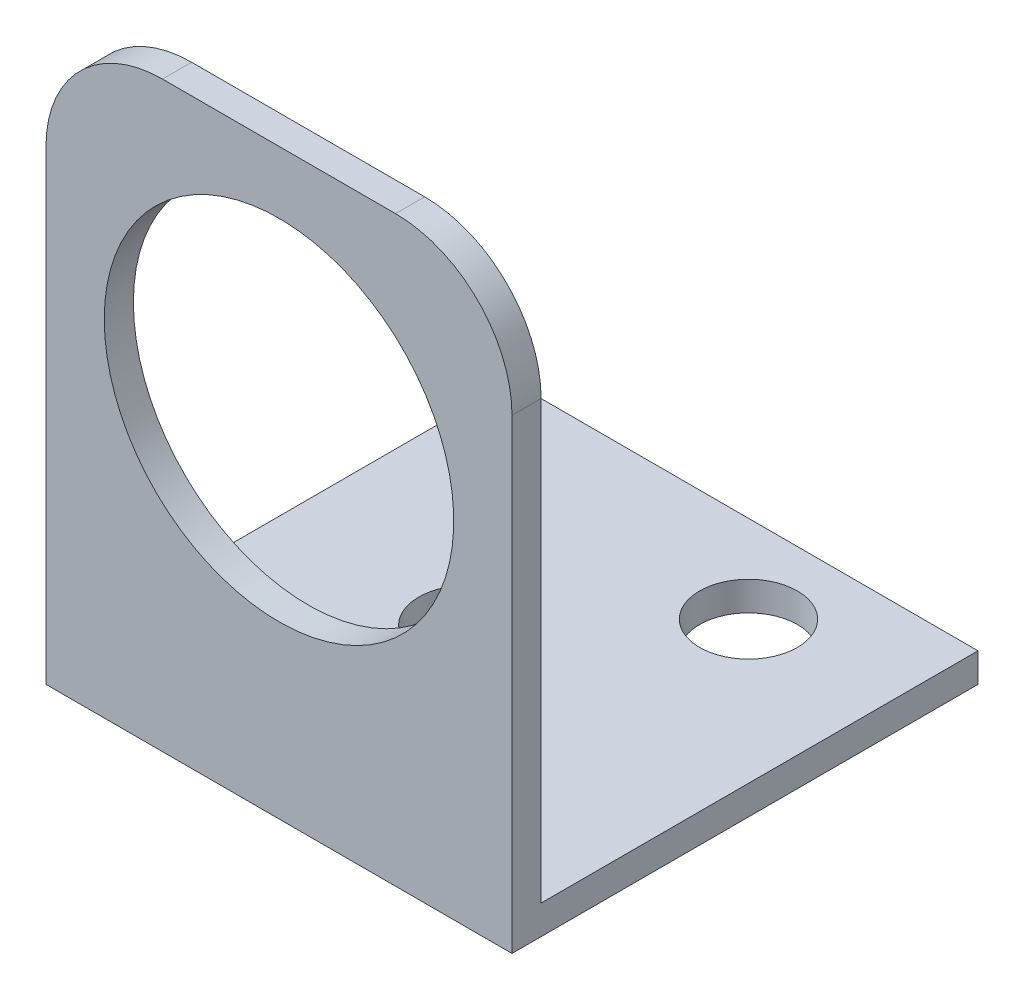
ISO-10303-21;
HEADER;
FILE_DESCRIPTION(('STEP AP214'),'2;1');
FILE_NAME('part.step','',(''),(''),'','','');
FILE_SCHEMA(('AUTOMOTIVE_DESIGN { 1 0 10303 214 1 1 1 1 }'));
ENDSEC;
DATA;
#1=APPLICATION_CONTEXT('core data for automotive mechanical design processes');
#2=APPLICATION_PROTOCOL_DEFINITION('international standard','automotive_design',2000,#1);
#3=PRODUCT_CONTEXT('',#1,'mechanical');
#4=PRODUCT('Part','Part','',(#3));
#5=PRODUCT_RELATED_PRODUCT_CATEGORY('part','',(#4));
#6=PRODUCT_DEFINITION_FORMATION('','',#4);
#7=PRODUCT_DEFINITION_CONTEXT('part definition',#1,'design');
#8=PRODUCT_DEFINITION('design','',#6,#7);
#9=PRODUCT_DEFINITION_SHAPE('','',#8);
#10=(LENGTH_UNIT() NAMED_UNIT(*) SI_UNIT(.MILLI.,.METRE.));
#11=(NAMED_UNIT(*) PLANE_ANGLE_UNIT() SI_UNIT($,.RADIAN.));
#12=(NAMED_UNIT(*) SI_UNIT($,.STERADIAN.) SOLID_ANGLE_UNIT());
#13=UNCERTAINTY_MEASURE_WITH_UNIT(LENGTH_MEASURE(1.E-05),#10,'distance_accuracy_value','');
#14=(GEOMETRIC_REPRESENTATION_CONTEXT(3) GLOBAL_UNCERTAINTY_ASSIGNED_CONTEXT((#13)) GLOBAL_UNIT_ASSIGNED_CONTEXT((#10,
#11,#12)) REPRESENTATION_CONTEXT('',''));
#15=CARTESIAN_POINT('',(0.,0.,0.));
#16=DIRECTION('',(0.,0.,1.));
#17=DIRECTION('',(1.,0.,0.));
#18=AXIS2_PLACEMENT_3D('',#15,#16,#17);
#19=CARTESIAN_POINT('',(25.4,0.,0.));
#20=DIRECTION('',(0.,0.,-1.));
#21=DIRECTION('',(-1.,0.,0.));
#22=AXIS2_PLACEMENT_3D('',#19,#20,#21);
#23=PLANE('',#22);
#24=CARTESIAN_POINT('',(12.7,18.8307473564399,0.));
#25=DIRECTION('',(0.,0.,-1.));
#26=DIRECTION('',(-1.,0.,0.));
#27=AXIS2_PLACEMENT_3D('',#24,#25,#26);
#28=CIRCLE('',#27,9.525);
#29=CARTESIAN_POINT('',(3.175,18.8307473564399,0.));
#30=VERTEX_POINT('',#29);
#31=EDGE_CURVE('E175',#30,#30,#28,.F.);
#32=ORIENTED_EDGE('',*,*,#31,.F.);
#33=EDGE_LOOP('',(#32));
#34=FACE_BOUND('',#33,.T.);
#35=DIRECTION('',(0.,-1.,0.));
#36=VECTOR('',#35,1.);
#37=CARTESIAN_POINT('',(25.4,0.,0.));
#38=LINE('',#37,#36);
#39=CARTESIAN_POINT('',(25.4,25.4,0.));
#40=VERTEX_POINT('',#39);
#41=CARTESIAN_POINT('',(25.4,0.,0.));
#42=VERTEX_POINT('',#41);
#43=EDGE_CURVE('E98',#40,#42,#38,.T.);
#44=ORIENTED_EDGE('',*,*,#43,.F.);
#45=CARTESIAN_POINT('',(19.05,25.4,0.));
#46=DIRECTION('',(0.,0.,-1.));
#47=DIRECTION('',(-1.,0.,0.));
#48=AXIS2_PLACEMENT_3D('',#45,#46,#47);
#49=CIRCLE('',#48,6.35);
#50=CARTESIAN_POINT('',(19.05,31.75,0.));
#51=VERTEX_POINT('',#50);
#52=EDGE_CURVE('E129',#40,#51,#49,.F.);
#53=ORIENTED_EDGE('',*,*,#52,.T.);
#54=DIRECTION('',(-1.,0.,0.));
#55=VECTOR('',#54,1.);
#56=CARTESIAN_POINT('',(25.4,31.75,0.));
#57=LINE('',#56,#55);
#58=CARTESIAN_POINT('',(6.35,31.75,0.));
#59=VERTEX_POINT('',#58);
#60=EDGE_CURVE('E147',#51,#59,#57,.T.);
#61=ORIENTED_EDGE('',*,*,#60,.T.);
#62=CARTESIAN_POINT('',(6.35,25.4,0.));
#63=DIRECTION('',(0.,0.,-1.));
#64=DIRECTION('',(-1.,0.,0.));
#65=AXIS2_PLACEMENT_3D('',#62,#63,#64);
#66=CIRCLE('',#65,6.35);
#67=CARTESIAN_POINT('',(0.,25.4,0.));
#68=VERTEX_POINT('',#67);
#69=EDGE_CURVE('E122',#59,#68,#66,.F.);
#70=ORIENTED_EDGE('',*,*,#69,.T.);
#71=DIRECTION('',(0.,-1.,0.));
#72=VECTOR('',#71,1.);
#73=CARTESIAN_POINT('',(0.,0.,0.));
#74=LINE('',#73,#72);
#75=CARTESIAN_POINT('',(0.,0.,0.));
#76=VERTEX_POINT('',#75);
#77=EDGE_CURVE('E119',#68,#76,#74,.T.);
#78=ORIENTED_EDGE('',*,*,#77,.T.);
#79=DIRECTION('',(-1.,0.,0.));
#80=VECTOR('',#79,1.);
#81=CARTESIAN_POINT('',(25.4,0.,0.));
#82=LINE('',#81,#80);
#83=EDGE_CURVE('E113',#42,#76,#82,.T.);
#84=ORIENTED_EDGE('',*,*,#83,.F.);
#85=EDGE_LOOP('',(#44,#53,#61,#70,#78,#84));
#86=FACE_BOUND('',#85,.T.);
#87=ADVANCED_FACE('F32',(#34,#86),#23,.F.);
#88=CARTESIAN_POINT('',(25.4,0.,0.));
#89=DIRECTION('',(0.,1.,0.));
#90=DIRECTION('',(0.,0.,1.));
#91=AXIS2_PLACEMENT_3D('',#88,#89,#90);
#92=PLANE('',#91);
#93=CARTESIAN_POINT('',(17.6529999999966,0.,-20.6375));
#94=DIRECTION('',(0.,-1.,0.));
#95=DIRECTION('',(0.,0.,-1.));
#96=AXIS2_PLACEMENT_3D('',#93,#94,#95);
#97=CIRCLE('',#96,2.667);
#98=CARTESIAN_POINT('',(17.6529999999966,0.,-23.3045));
#99=VERTEX_POINT('',#98);
#100=EDGE_CURVE('E188',#99,#99,#97,.T.);
#101=ORIENTED_EDGE('',*,*,#100,.F.);
#102=EDGE_LOOP('',(#101));
#103=FACE_BOUND('',#102,.T.);
#104=CARTESIAN_POINT('',(10.2869999999966,0.,-12.7));
#105=DIRECTION('',(0.,-1.,0.));
#106=DIRECTION('',(0.,0.,-1.));
#107=AXIS2_PLACEMENT_3D('',#104,#105,#106);
#108=CIRCLE('',#107,2.667);
#109=CARTESIAN_POINT('',(10.2869999999966,0.,-15.367));
#110=VERTEX_POINT('',#109);
#111=EDGE_CURVE('E189',#110,#110,#108,.T.);
#112=ORIENTED_EDGE('',*,*,#111,.F.);
#113=EDGE_LOOP('',(#112));
#114=FACE_BOUND('',#113,.T.);
#115=DIRECTION('',(0.,0.,-1.));
#116=VECTOR('',#115,1.);
#117=CARTESIAN_POINT('',(0.,0.,0.));
#118=LINE('',#117,#116);
#119=CARTESIAN_POINT('',(0.,0.,-25.4));
#120=VERTEX_POINT('',#119);
#121=EDGE_CURVE('E171',#76,#120,#118,.T.);
#122=ORIENTED_EDGE('',*,*,#121,.T.);
#123=DIRECTION('',(-1.,0.,0.));
#124=VECTOR('',#123,1.);
#125=CARTESIAN_POINT('',(25.4,0.,-25.4));
#126=LINE('',#125,#124);
#127=CARTESIAN_POINT('',(25.4,0.,-25.4));
#128=VERTEX_POINT('',#127);
#129=EDGE_CURVE('E115',#128,#120,#126,.T.);
#130=ORIENTED_EDGE('',*,*,#129,.F.);
#131=DIRECTION('',(0.,0.,-1.));
#132=VECTOR('',#131,1.);
#133=CARTESIAN_POINT('',(25.4,0.,0.));
#134=LINE('',#133,#132);
#135=EDGE_CURVE('E102',#42,#128,#134,.T.);
#136=ORIENTED_EDGE('',*,*,#135,.F.);
#137=ORIENTED_EDGE('',*,*,#83,.T.);
#138=EDGE_LOOP('',(#122,#130,#136,#137));
#139=FACE_BOUND('',#138,.T.);
#140=ADVANCED_FACE('F112',(#103,#114,#139),#92,.F.);
#141=CARTESIAN_POINT('',(25.4,0.,-25.4));
#142=DIRECTION('',(0.,0.,1.));
#143=DIRECTION('',(1.,0.,0.));
#144=AXIS2_PLACEMENT_3D('',#141,#142,#143);
#145=PLANE('',#144);
#146=DIRECTION('',(0.,1.,0.));
#147=VECTOR('',#146,1.);
#148=CARTESIAN_POINT('',(0.,0.,-25.4));
#149=LINE('',#148,#147);
#150=CARTESIAN_POINT('',(0.,1.5875,-25.4));
#151=VERTEX_POINT('',#150);
#152=EDGE_CURVE('E170',#120,#151,#149,.T.);
#153=ORIENTED_EDGE('',*,*,#152,.T.);
#154=DIRECTION('',(-1.,0.,0.));
#155=VECTOR('',#154,1.);
#156=CARTESIAN_POINT('',(25.4,1.5875,-25.4));
#157=LINE('',#156,#155);
#158=CARTESIAN_POINT('',(25.4,1.5875,-25.4));
#159=VERTEX_POINT('',#158);
#160=EDGE_CURVE('E124',#159,#151,#157,.T.);
#161=ORIENTED_EDGE('',*,*,#160,.F.);
#162=DIRECTION('',(0.,1.,0.));
#163=VECTOR('',#162,1.);
#164=CARTESIAN_POINT('',(25.4,0.,-25.4));
#165=LINE('',#164,#163);
#166=EDGE_CURVE('E117',#128,#159,#165,.T.);
#167=ORIENTED_EDGE('',*,*,#166,.F.);
#168=ORIENTED_EDGE('',*,*,#129,.T.);
#169=EDGE_LOOP('',(#153,#161,#167,#168));
#170=FACE_BOUND('',#169,.T.);
#171=ADVANCED_FACE('F202',(#170),#145,.F.);
#172=CARTESIAN_POINT('',(25.4,1.5875,-1.5875));
#173=DIRECTION('',(0.,-1.,0.));
#174=DIRECTION('',(0.,0.,-1.));
#175=AXIS2_PLACEMENT_3D('',#172,#173,#174);
#176=PLANE('',#175);
#177=CARTESIAN_POINT('',(17.6529999999966,1.5875,-20.6375));
#178=DIRECTION('',(0.,-1.,0.));
#179=DIRECTION('',(0.,0.,-1.));
#180=AXIS2_PLACEMENT_3D('',#177,#178,#179);
#181=CIRCLE('',#180,2.667);
#182=CARTESIAN_POINT('',(17.6529999999966,1.5875,-23.3045));
#183=VERTEX_POINT('',#182);
#184=EDGE_CURVE('E184',#183,#183,#181,.F.);
#185=ORIENTED_EDGE('',*,*,#184,.F.);
#186=EDGE_LOOP('',(#185));
#187=FACE_BOUND('',#186,.T.);
#188=CARTESIAN_POINT('',(10.2869999999966,1.5875,-12.7));
#189=DIRECTION('',(0.,-1.,0.));
#190=DIRECTION('',(0.,0.,-1.));
#191=AXIS2_PLACEMENT_3D('',#188,#189,#190);
#192=CIRCLE('',#191,2.667);
#193=CARTESIAN_POINT('',(10.2869999999966,1.5875,-15.367));
#194=VERTEX_POINT('',#193);
#195=EDGE_CURVE('E185',#194,#194,#192,.F.);
#196=ORIENTED_EDGE('',*,*,#195,.F.);
#197=EDGE_LOOP('',(#196));
#198=FACE_BOUND('',#197,.T.);
#199=DIRECTION('',(0.,0.,1.));
#200=VECTOR('',#199,1.);
#201=CARTESIAN_POINT('',(0.,1.5875,-1.5875));
#202=LINE('',#201,#200);
#203=CARTESIAN_POINT('',(0.,1.5875,-1.5875));
#204=VERTEX_POINT('',#203);
#205=EDGE_CURVE('E166',#151,#204,#202,.T.);
#206=ORIENTED_EDGE('',*,*,#205,.T.);
#207=DIRECTION('',(-1.,0.,0.));
#208=VECTOR('',#207,1.);
#209=CARTESIAN_POINT('',(25.4,1.5875,-1.5875));
#210=LINE('',#209,#208);
#211=CARTESIAN_POINT('',(25.4,1.5875,-1.5875));
#212=VERTEX_POINT('',#211);
#213=EDGE_CURVE('E156',#212,#204,#210,.T.);
#214=ORIENTED_EDGE('',*,*,#213,.F.);
#215=DIRECTION('',(0.,0.,1.));
#216=VECTOR('',#215,1.);
#217=CARTESIAN_POINT('',(25.4,1.5875,-1.5875));
#218=LINE('',#217,#216);
#219=EDGE_CURVE('E145',#159,#212,#218,.T.);
#220=ORIENTED_EDGE('',*,*,#219,.F.);
#221=ORIENTED_EDGE('',*,*,#160,.T.);
#222=EDGE_LOOP('',(#206,#214,#220,#221));
#223=FACE_BOUND('',#222,.T.);
#224=ADVANCED_FACE('F165',(#187,#198,#223),#176,.F.);
#225=CARTESIAN_POINT('',(25.4,1.5875,-1.5875));
#226=DIRECTION('',(0.,0.,1.));
#227=DIRECTION('',(1.,0.,0.));
#228=AXIS2_PLACEMENT_3D('',#225,#226,#227);
#229=PLANE('',#228);
#230=CARTESIAN_POINT('',(12.7,18.8307473564399,-1.5875));
#231=DIRECTION('',(0.,0.,-1.));
#232=DIRECTION('',(-1.,0.,0.));
#233=AXIS2_PLACEMENT_3D('',#230,#231,#232);
#234=CIRCLE('',#233,9.525);
#235=CARTESIAN_POINT('',(3.175,18.8307473564399,-1.5875));
#236=VERTEX_POINT('',#235);
#237=EDGE_CURVE('E181',#236,#236,#234,.T.);
#238=ORIENTED_EDGE('',*,*,#237,.F.);
#239=EDGE_LOOP('',(#238));
#240=FACE_BOUND('',#239,.T.);
#241=DIRECTION('',(-1.,0.,0.));
#242=VECTOR('',#241,1.);
#243=CARTESIAN_POINT('',(25.4,31.75,-1.5875));
#244=LINE('',#243,#242);
#245=CARTESIAN_POINT('',(19.05,31.75,-1.5875));
#246=VERTEX_POINT('',#245);
#247=CARTESIAN_POINT('',(6.35,31.75,-1.5875));
#248=VERTEX_POINT('',#247);
#249=EDGE_CURVE('E141',#246,#248,#244,.T.);
#250=ORIENTED_EDGE('',*,*,#249,.F.);
#251=CARTESIAN_POINT('',(19.05,25.4,-1.5875));
#252=DIRECTION('',(0.,0.,1.));
#253=DIRECTION('',(1.,0.,0.));
#254=AXIS2_PLACEMENT_3D('',#251,#252,#253);
#255=CIRCLE('',#254,6.35);
#256=CARTESIAN_POINT('',(25.4,25.4,-1.5875));
#257=VERTEX_POINT('',#256);
#258=EDGE_CURVE('E40',#246,#257,#255,.F.);
#259=ORIENTED_EDGE('',*,*,#258,.T.);
#260=DIRECTION('',(0.,1.,0.));
#261=VECTOR('',#260,1.);
#262=CARTESIAN_POINT('',(25.4,1.5875,-1.5875));
#263=LINE('',#262,#261);
#264=EDGE_CURVE('E140',#212,#257,#263,.T.);
#265=ORIENTED_EDGE('',*,*,#264,.F.);
#266=ORIENTED_EDGE('',*,*,#213,.T.);
#267=DIRECTION('',(0.,1.,0.));
#268=VECTOR('',#267,1.);
#269=CARTESIAN_POINT('',(0.,1.5875,-1.5875));
#270=LINE('',#269,#268);
#271=CARTESIAN_POINT('',(0.,25.4,-1.5875));
#272=VERTEX_POINT('',#271);
#273=EDGE_CURVE('E108',#204,#272,#270,.T.);
#274=ORIENTED_EDGE('',*,*,#273,.T.);
#275=CARTESIAN_POINT('',(6.35,25.4,-1.5875));
#276=DIRECTION('',(0.,0.,1.));
#277=DIRECTION('',(1.,0.,0.));
#278=AXIS2_PLACEMENT_3D('',#275,#276,#277);
#279=CIRCLE('',#278,6.35);
#280=EDGE_CURVE('E52',#272,#248,#279,.F.);
#281=ORIENTED_EDGE('',*,*,#280,.T.);
#282=EDGE_LOOP('',(#250,#259,#265,#266,#274,#281));
#283=FACE_BOUND('',#282,.T.);
#284=ADVANCED_FACE('F138',(#240,#283),#229,.F.);
#285=CARTESIAN_POINT('',(25.4,31.75,0.));
#286=DIRECTION('',(0.,-1.,0.));
#287=DIRECTION('',(0.,0.,-1.));
#288=AXIS2_PLACEMENT_3D('',#285,#286,#287);
#289=PLANE('',#288);
#290=ORIENTED_EDGE('',*,*,#60,.F.);
#291=DIRECTION('',(0.,0.,1.));
#292=VECTOR('',#291,1.);
#293=CARTESIAN_POINT('',(19.05,31.75,0.));
#294=LINE('',#293,#292);
#295=EDGE_CURVE('E134',#51,#246,#294,.F.);
#296=ORIENTED_EDGE('',*,*,#295,.T.);
#297=ORIENTED_EDGE('',*,*,#249,.T.);
#298=DIRECTION('',(0.,0.,1.));
#299=VECTOR('',#298,1.);
#300=CARTESIAN_POINT('',(6.35,31.75,0.));
#301=LINE('',#300,#299);
#302=EDGE_CURVE('E131',#248,#59,#301,.T.);
#303=ORIENTED_EDGE('',*,*,#302,.T.);
#304=EDGE_LOOP('',(#290,#296,#297,#303));
#305=FACE_BOUND('',#304,.T.);
#306=ADVANCED_FACE('F153',(#305),#289,.F.);
#307=CARTESIAN_POINT('',(25.4,0.,0.));
#308=DIRECTION('',(-1.,0.,0.));
#309=DIRECTION('',(0.,0.,1.));
#310=AXIS2_PLACEMENT_3D('',#307,#308,#309);
#311=PLANE('',#310);
#312=ORIENTED_EDGE('',*,*,#264,.T.);
#313=DIRECTION('',(0.,0.,1.));
#314=VECTOR('',#313,1.);
#315=CARTESIAN_POINT('',(25.4,25.4,0.));
#316=LINE('',#315,#314);
#317=EDGE_CURVE('E105',#257,#40,#316,.T.);
#318=ORIENTED_EDGE('',*,*,#317,.T.);
#319=ORIENTED_EDGE('',*,*,#43,.T.);
#320=ORIENTED_EDGE('',*,*,#135,.T.);
#321=ORIENTED_EDGE('',*,*,#166,.T.);
#322=ORIENTED_EDGE('',*,*,#219,.T.);
#323=EDGE_LOOP('',(#312,#318,#319,#320,#321,#322));
#324=FACE_BOUND('',#323,.T.);
#325=ADVANCED_FACE('F101',(#324),#311,.F.);
#326=CARTESIAN_POINT('',(0.,0.,0.));
#327=DIRECTION('',(-1.,0.,0.));
#328=DIRECTION('',(0.,0.,1.));
#329=AXIS2_PLACEMENT_3D('',#326,#327,#328);
#330=PLANE('',#329);
#331=ORIENTED_EDGE('',*,*,#77,.F.);
#332=DIRECTION('',(0.,0.,1.));
#333=VECTOR('',#332,1.);
#334=CARTESIAN_POINT('',(0.,25.4,-1.5875));
#335=LINE('',#334,#333);
#336=EDGE_CURVE('E11',#68,#272,#335,.F.);
#337=ORIENTED_EDGE('',*,*,#336,.T.);
#338=ORIENTED_EDGE('',*,*,#273,.F.);
#339=ORIENTED_EDGE('',*,*,#205,.F.);
#340=ORIENTED_EDGE('',*,*,#152,.F.);
#341=ORIENTED_EDGE('',*,*,#121,.F.);
#342=EDGE_LOOP('',(#331,#337,#338,#339,#340,#341));
#343=FACE_BOUND('',#342,.T.);
#344=ADVANCED_FACE('F169',(#343),#330,.T.);
#345=CARTESIAN_POINT('',(12.7,18.8307473564399,0.000999999999999916));
#346=DIRECTION('',(0.,0.,-1.));
#347=DIRECTION('',(-1.,0.,0.));
#348=AXIS2_PLACEMENT_3D('',#345,#346,#347);
#349=CYLINDRICAL_SURFACE('',#348,9.525);
#350=ORIENTED_EDGE('',*,*,#237,.T.);
#351=EDGE_LOOP('',(#350));
#352=FACE_BOUND('',#351,.T.);
#353=ORIENTED_EDGE('',*,*,#31,.T.);
#354=EDGE_LOOP('',(#353));
#355=FACE_BOUND('',#354,.T.);
#356=ADVANCED_FACE('F230',(#352,#355),#349,.F.);
#357=CARTESIAN_POINT('',(19.05,25.4,0.));
#358=DIRECTION('',(0.,0.,1.));
#359=DIRECTION('',(1.,0.,0.));
#360=AXIS2_PLACEMENT_3D('',#357,#358,#359);
#361=CYLINDRICAL_SURFACE('',#360,6.35);
#362=ORIENTED_EDGE('',*,*,#258,.F.);
#363=ORIENTED_EDGE('',*,*,#295,.F.);
#364=ORIENTED_EDGE('',*,*,#52,.F.);
#365=ORIENTED_EDGE('',*,*,#317,.F.);
#366=EDGE_LOOP('',(#362,#363,#364,#365));
#367=FACE_BOUND('',#366,.T.);
#368=ADVANCED_FACE('F149',(#367),#361,.T.);
#369=CARTESIAN_POINT('',(6.35,25.4,0.));
#370=DIRECTION('',(0.,0.,-1.));
#371=DIRECTION('',(-1.,0.,0.));
#372=AXIS2_PLACEMENT_3D('',#369,#370,#371);
#373=CYLINDRICAL_SURFACE('',#372,6.35);
#374=ORIENTED_EDGE('',*,*,#280,.F.);
#375=ORIENTED_EDGE('',*,*,#336,.F.);
#376=ORIENTED_EDGE('',*,*,#69,.F.);
#377=ORIENTED_EDGE('',*,*,#302,.F.);
#378=EDGE_LOOP('',(#374,#375,#376,#377));
#379=FACE_BOUND('',#378,.T.);
#380=ADVANCED_FACE('F34',(#379),#373,.T.);
#381=CARTESIAN_POINT('',(10.2869999999966,31.751,-12.7));
#382=DIRECTION('',(0.,-1.,0.));
#383=DIRECTION('',(0.,0.,-1.));
#384=AXIS2_PLACEMENT_3D('',#381,#382,#383);
#385=CYLINDRICAL_SURFACE('',#384,2.667);
#386=ORIENTED_EDGE('',*,*,#111,.T.);
#387=EDGE_LOOP('',(#386));
#388=FACE_BOUND('',#387,.T.);
#389=ORIENTED_EDGE('',*,*,#195,.T.);
#390=EDGE_LOOP('',(#389));
#391=FACE_BOUND('',#390,.T.);
#392=ADVANCED_FACE('F206',(#388,#391),#385,.F.);
#393=CARTESIAN_POINT('',(17.6529999999966,31.751,-20.6375));
#394=DIRECTION('',(0.,-1.,0.));
#395=DIRECTION('',(0.,0.,-1.));
#396=AXIS2_PLACEMENT_3D('',#393,#394,#395);
#397=CYLINDRICAL_SURFACE('',#396,2.667);
#398=ORIENTED_EDGE('',*,*,#100,.T.);
#399=EDGE_LOOP('',(#398));
#400=FACE_BOUND('',#399,.T.);
#401=ORIENTED_EDGE('',*,*,#184,.T.);
#402=EDGE_LOOP('',(#401));
#403=FACE_BOUND('',#402,.T.);
#404=ADVANCED_FACE('F197',(#400,#403),#397,.F.);
#405=CLOSED_SHELL('',(#87,#140,#171,#224,#284,#306,#325,#344,#356,#368,#380,#392,#404));
#406=MANIFOLD_SOLID_BREP('B2',#405);
#407=ADVANCED_BREP_SHAPE_REPRESENTATION('',(#18,#406),#14);
#408=SHAPE_DEFINITION_REPRESENTATION(#9,#407);
ENDSEC;
END-ISO-10303-21;
